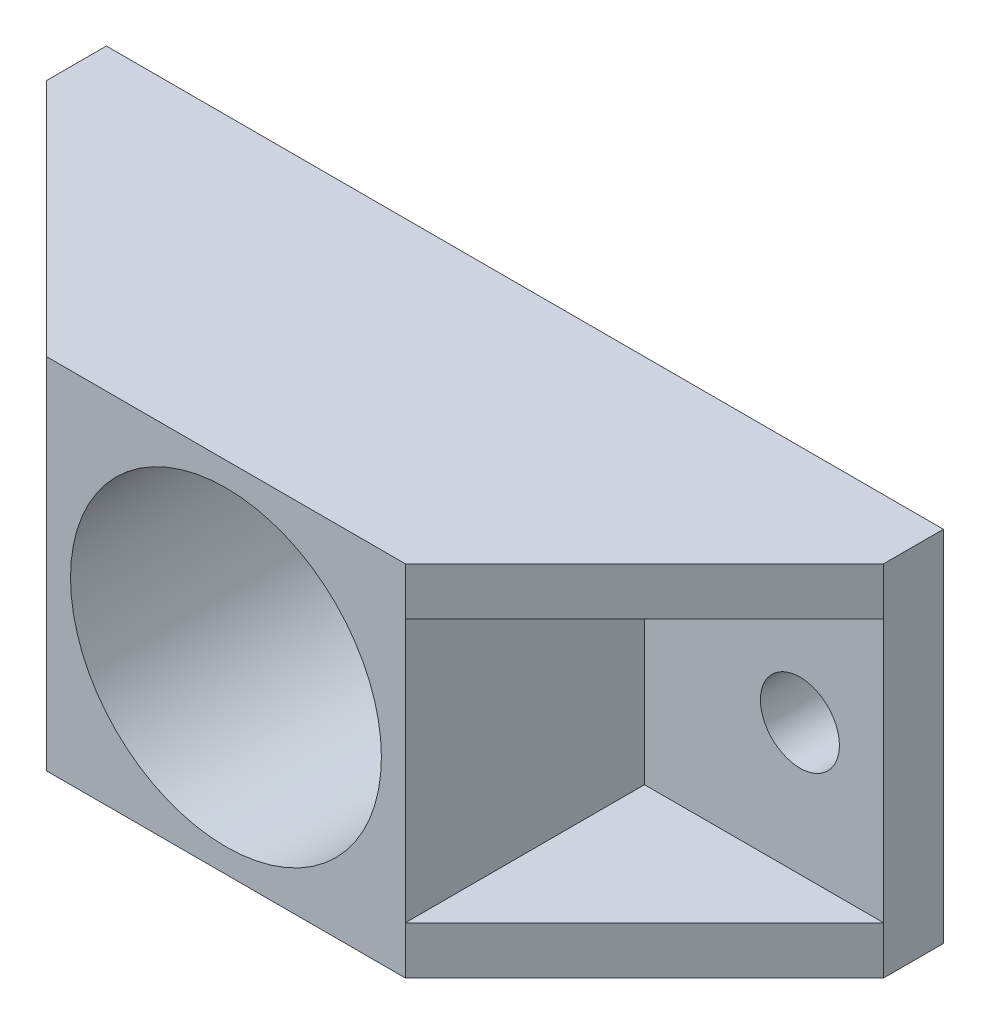
ISO-10303-21;
HEADER;
FILE_DESCRIPTION(('STEP AP214'),'2;1');
FILE_NAME('part.step','',(''),(''),'','','');
FILE_SCHEMA(('AUTOMOTIVE_DESIGN { 1 0 10303 214 1 1 1 1 }'));
ENDSEC;
DATA;
#1=APPLICATION_CONTEXT('core data for automotive mechanical design processes');
#2=APPLICATION_PROTOCOL_DEFINITION('international standard','automotive_design',2000,#1);
#3=PRODUCT_CONTEXT('',#1,'mechanical');
#4=PRODUCT('Part','Part','',(#3));
#5=PRODUCT_RELATED_PRODUCT_CATEGORY('part','',(#4));
#6=PRODUCT_DEFINITION_FORMATION('','',#4);
#7=PRODUCT_DEFINITION_CONTEXT('part definition',#1,'design');
#8=PRODUCT_DEFINITION('design','',#6,#7);
#9=PRODUCT_DEFINITION_SHAPE('','',#8);
#10=(LENGTH_UNIT() NAMED_UNIT(*) SI_UNIT(.MILLI.,.METRE.));
#11=(NAMED_UNIT(*) PLANE_ANGLE_UNIT() SI_UNIT($,.RADIAN.));
#12=(NAMED_UNIT(*) SI_UNIT($,.STERADIAN.) SOLID_ANGLE_UNIT());
#13=UNCERTAINTY_MEASURE_WITH_UNIT(LENGTH_MEASURE(1.E-05),#10,'distance_accuracy_value','');
#14=(GEOMETRIC_REPRESENTATION_CONTEXT(3) GLOBAL_UNCERTAINTY_ASSIGNED_CONTEXT((#13)) GLOBAL_UNIT_ASSIGNED_CONTEXT((#10,
#11,#12)) REPRESENTATION_CONTEXT('',''));
#15=CARTESIAN_POINT('',(0.,0.,0.));
#16=DIRECTION('',(0.,0.,1.));
#17=DIRECTION('',(1.,0.,0.));
#18=AXIS2_PLACEMENT_3D('',#15,#16,#17);
#19=CARTESIAN_POINT('',(0.,0.,5.));
#20=DIRECTION('',(0.,0.,-1.));
#21=DIRECTION('',(-1.,0.,0.));
#22=AXIS2_PLACEMENT_3D('',#19,#20,#21);
#23=PLANE('',#22);
#24=CARTESIAN_POINT('',(28.,0.,5.));
#25=DIRECTION('',(0.,0.,1.));
#26=DIRECTION('',(-1.,0.,0.));
#27=AXIS2_PLACEMENT_3D('',#24,#25,#26);
#28=CIRCLE('',#27,3.3);
#29=CARTESIAN_POINT('',(24.7,0.,5.));
#30=VERTEX_POINT('',#29);
#31=EDGE_CURVE('E173',#30,#30,#28,.T.);
#32=ORIENTED_EDGE('',*,*,#31,.F.);
#33=EDGE_LOOP('',(#32));
#34=FACE_BOUND('',#33,.T.);
#35=DIRECTION('',(1.,0.,0.));
#36=VECTOR('',#35,1.);
#37=CARTESIAN_POINT('',(35.,11.,5.));
#38=LINE('',#37,#36);
#39=CARTESIAN_POINT('',(15.,11.,5.));
#40=VERTEX_POINT('',#39);
#41=CARTESIAN_POINT('',(35.,11.,5.));
#42=VERTEX_POINT('',#41);
#43=EDGE_CURVE('E132',#40,#42,#38,.T.);
#44=ORIENTED_EDGE('',*,*,#43,.F.);
#45=DIRECTION('',(0.,1.,0.));
#46=VECTOR('',#45,1.);
#47=CARTESIAN_POINT('',(15.,-15.,5.));
#48=LINE('',#47,#46);
#49=CARTESIAN_POINT('',(15.,-11.,5.));
#50=VERTEX_POINT('',#49);
#51=EDGE_CURVE('E155',#50,#40,#48,.T.);
#52=ORIENTED_EDGE('',*,*,#51,.F.);
#53=DIRECTION('',(1.,0.,0.));
#54=VECTOR('',#53,1.);
#55=CARTESIAN_POINT('',(35.,-11.,5.));
#56=LINE('',#55,#54);
#57=CARTESIAN_POINT('',(35.,-11.,5.));
#58=VERTEX_POINT('',#57);
#59=EDGE_CURVE('E235',#50,#58,#56,.T.);
#60=ORIENTED_EDGE('',*,*,#59,.T.);
#61=DIRECTION('',(0.,1.,0.));
#62=VECTOR('',#61,1.);
#63=CARTESIAN_POINT('',(35.,15.,5.));
#64=LINE('',#63,#62);
#65=EDGE_CURVE('E198',#58,#42,#64,.T.);
#66=ORIENTED_EDGE('',*,*,#65,.T.);
#67=EDGE_LOOP('',(#44,#52,#60,#66));
#68=FACE_BOUND('',#67,.T.);
#69=ADVANCED_FACE('F35',(#34,#68),#23,.F.);
#70=CARTESIAN_POINT('',(15.,-15.,25.));
#71=DIRECTION('',(-1.,0.,0.));
#72=DIRECTION('',(0.,0.,1.));
#73=AXIS2_PLACEMENT_3D('',#70,#71,#72);
#74=PLANE('',#73);
#75=DIRECTION('',(0.,0.,-1.));
#76=VECTOR('',#75,1.);
#77=CARTESIAN_POINT('',(15.,11.,5.));
#78=LINE('',#77,#76);
#79=CARTESIAN_POINT('',(15.,11.,25.));
#80=VERTEX_POINT('',#79);
#81=EDGE_CURVE('E130',#80,#40,#78,.T.);
#82=ORIENTED_EDGE('',*,*,#81,.F.);
#83=DIRECTION('',(0.,1.,0.));
#84=VECTOR('',#83,1.);
#85=CARTESIAN_POINT('',(15.,-15.,25.));
#86=LINE('',#85,#84);
#87=CARTESIAN_POINT('',(15.,-11.,25.));
#88=VERTEX_POINT('',#87);
#89=EDGE_CURVE('E152',#88,#80,#86,.T.);
#90=ORIENTED_EDGE('',*,*,#89,.F.);
#91=DIRECTION('',(0.,0.,-1.));
#92=VECTOR('',#91,1.);
#93=CARTESIAN_POINT('',(15.,-11.,5.));
#94=LINE('',#93,#92);
#95=EDGE_CURVE('E233',#88,#50,#94,.T.);
#96=ORIENTED_EDGE('',*,*,#95,.T.);
#97=ORIENTED_EDGE('',*,*,#51,.T.);
#98=EDGE_LOOP('',(#82,#90,#96,#97));
#99=FACE_BOUND('',#98,.T.);
#100=ADVANCED_FACE('F150',(#99),#74,.F.);
#101=CARTESIAN_POINT('',(-28.,0.,5.));
#102=DIRECTION('',(0.,0.,1.));
#103=DIRECTION('',(1.,0.,0.));
#104=AXIS2_PLACEMENT_3D('',#101,#102,#103);
#105=CIRCLE('',#104,3.3);
#106=CARTESIAN_POINT('',(-24.7,0.,5.));
#107=VERTEX_POINT('',#106);
#108=EDGE_CURVE('E196',#107,#107,#105,.T.);
#109=ORIENTED_EDGE('',*,*,#108,.F.);
#110=EDGE_LOOP('',(#109));
#111=FACE_BOUND('',#110,.T.);
#112=DIRECTION('',(1.,0.,0.));
#113=VECTOR('',#112,1.);
#114=CARTESIAN_POINT('',(-15.,11.,5.));
#115=LINE('',#114,#113);
#116=CARTESIAN_POINT('',(-35.,11.,5.));
#117=VERTEX_POINT('',#116);
#118=CARTESIAN_POINT('',(-15.,11.,5.));
#119=VERTEX_POINT('',#118);
#120=EDGE_CURVE('E226',#117,#119,#115,.T.);
#121=ORIENTED_EDGE('',*,*,#120,.F.);
#122=DIRECTION('',(0.,-1.,0.));
#123=VECTOR('',#122,1.);
#124=CARTESIAN_POINT('',(-35.,15.,5.));
#125=LINE('',#124,#123);
#126=CARTESIAN_POINT('',(-35.,-11.,5.));
#127=VERTEX_POINT('',#126);
#128=EDGE_CURVE('E188',#117,#127,#125,.T.);
#129=ORIENTED_EDGE('',*,*,#128,.T.);
#130=DIRECTION('',(1.,0.,0.));
#131=VECTOR('',#130,1.);
#132=CARTESIAN_POINT('',(-15.,-11.,5.));
#133=LINE('',#132,#131);
#134=CARTESIAN_POINT('',(-15.,-11.,5.));
#135=VERTEX_POINT('',#134);
#136=EDGE_CURVE('E241',#127,#135,#133,.T.);
#137=ORIENTED_EDGE('',*,*,#136,.T.);
#138=DIRECTION('',(0.,-1.,0.));
#139=VECTOR('',#138,1.);
#140=CARTESIAN_POINT('',(-15.,-15.,5.));
#141=LINE('',#140,#139);
#142=EDGE_CURVE('E39',#119,#135,#141,.T.);
#143=ORIENTED_EDGE('',*,*,#142,.F.);
#144=EDGE_LOOP('',(#121,#129,#137,#143));
#145=FACE_BOUND('',#144,.T.);
#146=ADVANCED_FACE('F217',(#111,#145),#23,.F.);
#147=CARTESIAN_POINT('',(-15.,-15.,25.));
#148=DIRECTION('',(1.,0.,0.));
#149=DIRECTION('',(0.,0.,-1.));
#150=AXIS2_PLACEMENT_3D('',#147,#148,#149);
#151=PLANE('',#150);
#152=DIRECTION('',(0.,0.,1.));
#153=VECTOR('',#152,1.);
#154=CARTESIAN_POINT('',(-15.,11.,25.));
#155=LINE('',#154,#153);
#156=CARTESIAN_POINT('',(-15.,11.,25.));
#157=VERTEX_POINT('',#156);
#158=EDGE_CURVE('E229',#119,#157,#155,.T.);
#159=ORIENTED_EDGE('',*,*,#158,.F.);
#160=ORIENTED_EDGE('',*,*,#142,.T.);
#161=DIRECTION('',(0.,0.,1.));
#162=VECTOR('',#161,1.);
#163=CARTESIAN_POINT('',(-15.,-11.,25.));
#164=LINE('',#163,#162);
#165=CARTESIAN_POINT('',(-15.,-11.,25.));
#166=VERTEX_POINT('',#165);
#167=EDGE_CURVE('E244',#135,#166,#164,.T.);
#168=ORIENTED_EDGE('',*,*,#167,.T.);
#169=DIRECTION('',(0.,-1.,0.));
#170=VECTOR('',#169,1.);
#171=CARTESIAN_POINT('',(-15.,-15.,25.));
#172=LINE('',#171,#170);
#173=EDGE_CURVE('E175',#157,#166,#172,.T.);
#174=ORIENTED_EDGE('',*,*,#173,.F.);
#175=EDGE_LOOP('',(#159,#160,#168,#174));
#176=FACE_BOUND('',#175,.T.);
#177=ADVANCED_FACE('F275',(#176),#151,.F.);
#178=CARTESIAN_POINT('',(0.,0.,0.));
#179=DIRECTION('',(0.,0.,-1.));
#180=DIRECTION('',(-1.,0.,0.));
#181=AXIS2_PLACEMENT_3D('',#178,#179,#180);
#182=PLANE('',#181);
#183=CARTESIAN_POINT('',(0.,0.,0.));
#184=DIRECTION('',(0.,0.,1.));
#185=DIRECTION('',(1.,0.,0.));
#186=AXIS2_PLACEMENT_3D('',#183,#184,#185);
#187=CIRCLE('',#186,13.);
#188=CARTESIAN_POINT('',(13.,0.,0.));
#189=VERTEX_POINT('',#188);
#190=EDGE_CURVE('E258',#189,#189,#187,.T.);
#191=ORIENTED_EDGE('',*,*,#190,.T.);
#192=EDGE_LOOP('',(#191));
#193=FACE_BOUND('',#192,.T.);
#194=CARTESIAN_POINT('',(-28.,0.,0.));
#195=DIRECTION('',(0.,0.,1.));
#196=DIRECTION('',(1.,0.,0.));
#197=AXIS2_PLACEMENT_3D('',#194,#195,#196);
#198=CIRCLE('',#197,3.3);
#199=CARTESIAN_POINT('',(-24.7,0.,0.));
#200=VERTEX_POINT('',#199);
#201=EDGE_CURVE('E201',#200,#200,#198,.T.);
#202=ORIENTED_EDGE('',*,*,#201,.T.);
#203=EDGE_LOOP('',(#202));
#204=FACE_BOUND('',#203,.T.);
#205=DIRECTION('',(0.,-1.,0.));
#206=VECTOR('',#205,1.);
#207=CARTESIAN_POINT('',(-35.,15.,0.));
#208=LINE('',#207,#206);
#209=CARTESIAN_POINT('',(-35.,15.,0.));
#210=VERTEX_POINT('',#209);
#211=CARTESIAN_POINT('',(-35.,-15.,0.));
#212=VERTEX_POINT('',#211);
#213=EDGE_CURVE('E193',#210,#212,#208,.T.);
#214=ORIENTED_EDGE('',*,*,#213,.F.);
#215=DIRECTION('',(-1.,0.,0.));
#216=VECTOR('',#215,1.);
#217=CARTESIAN_POINT('',(35.,15.,0.));
#218=LINE('',#217,#216);
#219=CARTESIAN_POINT('',(35.,15.,0.));
#220=VERTEX_POINT('',#219);
#221=EDGE_CURVE('E186',#220,#210,#218,.T.);
#222=ORIENTED_EDGE('',*,*,#221,.F.);
#223=DIRECTION('',(0.,1.,0.));
#224=VECTOR('',#223,1.);
#225=CARTESIAN_POINT('',(35.,15.,0.));
#226=LINE('',#225,#224);
#227=CARTESIAN_POINT('',(35.,-15.,0.));
#228=VERTEX_POINT('',#227);
#229=EDGE_CURVE('E189',#228,#220,#226,.T.);
#230=ORIENTED_EDGE('',*,*,#229,.F.);
#231=DIRECTION('',(1.,0.,0.));
#232=VECTOR('',#231,1.);
#233=CARTESIAN_POINT('',(35.,-15.,0.));
#234=LINE('',#233,#232);
#235=EDGE_CURVE('E191',#212,#228,#234,.T.);
#236=ORIENTED_EDGE('',*,*,#235,.F.);
#237=EDGE_LOOP('',(#214,#222,#230,#236));
#238=FACE_BOUND('',#237,.T.);
#239=CARTESIAN_POINT('',(28.,0.,0.));
#240=DIRECTION('',(0.,0.,1.));
#241=DIRECTION('',(-1.,0.,0.));
#242=AXIS2_PLACEMENT_3D('',#239,#240,#241);
#243=CIRCLE('',#242,3.3);
#244=CARTESIAN_POINT('',(24.7,0.,0.));
#245=VERTEX_POINT('',#244);
#246=EDGE_CURVE('E168',#245,#245,#243,.T.);
#247=ORIENTED_EDGE('',*,*,#246,.T.);
#248=EDGE_LOOP('',(#247));
#249=FACE_BOUND('',#248,.T.);
#250=ADVANCED_FACE('F328',(#193,#204,#238,#249),#182,.T.);
#251=CARTESIAN_POINT('',(-35.,15.,5.));
#252=DIRECTION('',(1.,0.,0.));
#253=DIRECTION('',(0.,1.,0.));
#254=AXIS2_PLACEMENT_3D('',#251,#252,#253);
#255=PLANE('',#254);
#256=ORIENTED_EDGE('',*,*,#213,.T.);
#257=DIRECTION('',(0.,0.,-1.));
#258=VECTOR('',#257,1.);
#259=CARTESIAN_POINT('',(-35.,-15.,5.));
#260=LINE('',#259,#258);
#261=CARTESIAN_POINT('',(-35.,-15.,5.));
#262=VERTEX_POINT('',#261);
#263=EDGE_CURVE('E11',#262,#212,#260,.T.);
#264=ORIENTED_EDGE('',*,*,#263,.F.);
#265=DIRECTION('',(0.,-1.,0.));
#266=VECTOR('',#265,1.);
#267=CARTESIAN_POINT('',(-35.,-11.,5.));
#268=LINE('',#267,#266);
#269=EDGE_CURVE('E253',#127,#262,#268,.T.);
#270=ORIENTED_EDGE('',*,*,#269,.F.);
#271=ORIENTED_EDGE('',*,*,#128,.F.);
#272=CARTESIAN_POINT('',(-35.,15.,5.));
#273=VERTEX_POINT('',#272);
#274=EDGE_CURVE('E199',#273,#117,#125,.T.);
#275=ORIENTED_EDGE('',*,*,#274,.F.);
#276=DIRECTION('',(0.,0.,-1.));
#277=VECTOR('',#276,1.);
#278=CARTESIAN_POINT('',(-35.,15.,5.));
#279=LINE('',#278,#277);
#280=EDGE_CURVE('E182',#273,#210,#279,.T.);
#281=ORIENTED_EDGE('',*,*,#280,.T.);
#282=EDGE_LOOP('',(#256,#264,#270,#271,#275,#281));
#283=FACE_BOUND('',#282,.T.);
#284=ADVANCED_FACE('F37',(#283),#255,.F.);
#285=CARTESIAN_POINT('',(35.,-15.,5.));
#286=DIRECTION('',(0.,1.,0.));
#287=DIRECTION('',(0.,0.,1.));
#288=AXIS2_PLACEMENT_3D('',#285,#286,#287);
#289=PLANE('',#288);
#290=DIRECTION('',(0.,0.,-1.));
#291=VECTOR('',#290,1.);
#292=CARTESIAN_POINT('',(35.,-15.,5.));
#293=LINE('',#292,#291);
#294=CARTESIAN_POINT('',(35.,-15.,5.));
#295=VERTEX_POINT('',#294);
#296=EDGE_CURVE('E45',#295,#228,#293,.T.);
#297=ORIENTED_EDGE('',*,*,#296,.F.);
#298=DIRECTION('',(-0.707106781186547,0.,0.707106781186548));
#299=VECTOR('',#298,1.);
#300=CARTESIAN_POINT('',(15.,-15.,25.));
#301=LINE('',#300,#299);
#302=CARTESIAN_POINT('',(15.,-15.,25.));
#303=VERTEX_POINT('',#302);
#304=EDGE_CURVE('E231',#295,#303,#301,.T.);
#305=ORIENTED_EDGE('',*,*,#304,.T.);
#306=DIRECTION('',(1.,0.,0.));
#307=VECTOR('',#306,1.);
#308=CARTESIAN_POINT('',(15.,-15.,25.));
#309=LINE('',#308,#307);
#310=CARTESIAN_POINT('',(-15.,-15.,25.));
#311=VERTEX_POINT('',#310);
#312=EDGE_CURVE('E161',#311,#303,#309,.T.);
#313=ORIENTED_EDGE('',*,*,#312,.F.);
#314=DIRECTION('',(-0.707106781186547,0.,-0.707106781186548));
#315=VECTOR('',#314,1.);
#316=CARTESIAN_POINT('',(-35.,-15.,5.));
#317=LINE('',#316,#315);
#318=EDGE_CURVE('E238',#311,#262,#317,.T.);
#319=ORIENTED_EDGE('',*,*,#318,.T.);
#320=ORIENTED_EDGE('',*,*,#263,.T.);
#321=ORIENTED_EDGE('',*,*,#235,.T.);
#322=EDGE_LOOP('',(#297,#305,#313,#319,#320,#321));
#323=FACE_BOUND('',#322,.T.);
#324=ADVANCED_FACE('F285',(#323),#289,.F.);
#325=CARTESIAN_POINT('',(35.,15.,5.));
#326=DIRECTION('',(-1.,0.,0.));
#327=DIRECTION('',(0.,-1.,0.));
#328=AXIS2_PLACEMENT_3D('',#325,#326,#327);
#329=PLANE('',#328);
#330=ORIENTED_EDGE('',*,*,#229,.T.);
#331=DIRECTION('',(0.,0.,-1.));
#332=VECTOR('',#331,1.);
#333=CARTESIAN_POINT('',(35.,15.,5.));
#334=LINE('',#333,#332);
#335=CARTESIAN_POINT('',(35.,15.,5.));
#336=VERTEX_POINT('',#335);
#337=EDGE_CURVE('E179',#336,#220,#334,.T.);
#338=ORIENTED_EDGE('',*,*,#337,.F.);
#339=DIRECTION('',(0.,1.,0.));
#340=VECTOR('',#339,1.);
#341=CARTESIAN_POINT('',(35.,11.,5.));
#342=LINE('',#341,#340);
#343=EDGE_CURVE('E145',#42,#336,#342,.T.);
#344=ORIENTED_EDGE('',*,*,#343,.F.);
#345=ORIENTED_EDGE('',*,*,#65,.F.);
#346=EDGE_CURVE('E185',#295,#58,#64,.T.);
#347=ORIENTED_EDGE('',*,*,#346,.F.);
#348=ORIENTED_EDGE('',*,*,#296,.T.);
#349=EDGE_LOOP('',(#330,#338,#344,#345,#347,#348));
#350=FACE_BOUND('',#349,.T.);
#351=ADVANCED_FACE('F291',(#350),#329,.F.);
#352=CARTESIAN_POINT('',(35.,15.,5.));
#353=DIRECTION('',(0.,-1.,0.));
#354=DIRECTION('',(1.,0.,0.));
#355=AXIS2_PLACEMENT_3D('',#352,#353,#354);
#356=PLANE('',#355);
#357=ORIENTED_EDGE('',*,*,#280,.F.);
#358=DIRECTION('',(-0.707106781186547,0.,-0.707106781186548));
#359=VECTOR('',#358,1.);
#360=CARTESIAN_POINT('',(-35.,15.,5.));
#361=LINE('',#360,#359);
#362=CARTESIAN_POINT('',(-15.,15.,25.));
#363=VERTEX_POINT('',#362);
#364=EDGE_CURVE('E224',#363,#273,#361,.T.);
#365=ORIENTED_EDGE('',*,*,#364,.F.);
#366=DIRECTION('',(-1.,0.,0.));
#367=VECTOR('',#366,1.);
#368=CARTESIAN_POINT('',(15.,15.,25.));
#369=LINE('',#368,#367);
#370=CARTESIAN_POINT('',(15.,15.,25.));
#371=VERTEX_POINT('',#370);
#372=EDGE_CURVE('E163',#371,#363,#369,.T.);
#373=ORIENTED_EDGE('',*,*,#372,.F.);
#374=DIRECTION('',(-0.707106781186547,0.,0.707106781186548));
#375=VECTOR('',#374,1.);
#376=CARTESIAN_POINT('',(15.,15.,25.));
#377=LINE('',#376,#375);
#378=EDGE_CURVE('E140',#336,#371,#377,.T.);
#379=ORIENTED_EDGE('',*,*,#378,.F.);
#380=ORIENTED_EDGE('',*,*,#337,.T.);
#381=ORIENTED_EDGE('',*,*,#221,.T.);
#382=EDGE_LOOP('',(#357,#365,#373,#379,#380,#381));
#383=FACE_BOUND('',#382,.T.);
#384=ADVANCED_FACE('F295',(#383),#356,.F.);
#385=CARTESIAN_POINT('',(-28.,0.,5.));
#386=DIRECTION('',(0.,0.,-1.));
#387=DIRECTION('',(-1.,0.,0.));
#388=AXIS2_PLACEMENT_3D('',#385,#386,#387);
#389=CYLINDRICAL_SURFACE('',#388,3.3);
#390=ORIENTED_EDGE('',*,*,#108,.T.);
#391=EDGE_LOOP('',(#390));
#392=FACE_BOUND('',#391,.T.);
#393=ORIENTED_EDGE('',*,*,#201,.F.);
#394=EDGE_LOOP('',(#393));
#395=FACE_BOUND('',#394,.T.);
#396=ADVANCED_FACE('F331',(#392,#395),#389,.F.);
#397=CARTESIAN_POINT('',(28.,0.,5.));
#398=DIRECTION('',(0.,0.,-1.));
#399=DIRECTION('',(-1.,0.,0.));
#400=AXIS2_PLACEMENT_3D('',#397,#398,#399);
#401=CYLINDRICAL_SURFACE('',#400,3.3);
#402=ORIENTED_EDGE('',*,*,#31,.T.);
#403=EDGE_LOOP('',(#402));
#404=FACE_BOUND('',#403,.T.);
#405=ORIENTED_EDGE('',*,*,#246,.F.);
#406=EDGE_LOOP('',(#405));
#407=FACE_BOUND('',#406,.T.);
#408=ADVANCED_FACE('F211',(#404,#407),#401,.F.);
#409=CARTESIAN_POINT('',(0.,0.,25.));
#410=DIRECTION('',(0.,0.,1.));
#411=DIRECTION('',(1.,0.,0.));
#412=AXIS2_PLACEMENT_3D('',#409,#410,#411);
#413=PLANE('',#412);
#414=CARTESIAN_POINT('',(0.,0.,25.));
#415=DIRECTION('',(0.,0.,1.));
#416=DIRECTION('',(1.,0.,0.));
#417=AXIS2_PLACEMENT_3D('',#414,#415,#416);
#418=CIRCLE('',#417,13.);
#419=CARTESIAN_POINT('',(13.,0.,25.));
#420=VERTEX_POINT('',#419);
#421=EDGE_CURVE('E255',#420,#420,#418,.T.);
#422=ORIENTED_EDGE('',*,*,#421,.F.);
#423=EDGE_LOOP('',(#422));
#424=FACE_BOUND('',#423,.T.);
#425=EDGE_CURVE('E164',#363,#157,#172,.T.);
#426=ORIENTED_EDGE('',*,*,#425,.T.);
#427=ORIENTED_EDGE('',*,*,#173,.T.);
#428=DIRECTION('',(0.,-1.,0.));
#429=VECTOR('',#428,1.);
#430=CARTESIAN_POINT('',(-15.,-11.,25.));
#431=LINE('',#430,#429);
#432=EDGE_CURVE('E250',#166,#311,#431,.T.);
#433=ORIENTED_EDGE('',*,*,#432,.T.);
#434=ORIENTED_EDGE('',*,*,#312,.T.);
#435=EDGE_CURVE('E160',#303,#88,#86,.T.);
#436=ORIENTED_EDGE('',*,*,#435,.T.);
#437=ORIENTED_EDGE('',*,*,#89,.T.);
#438=DIRECTION('',(0.,1.,0.));
#439=VECTOR('',#438,1.);
#440=CARTESIAN_POINT('',(15.,11.,25.));
#441=LINE('',#440,#439);
#442=EDGE_CURVE('E137',#80,#371,#441,.T.);
#443=ORIENTED_EDGE('',*,*,#442,.T.);
#444=ORIENTED_EDGE('',*,*,#372,.T.);
#445=EDGE_LOOP('',(#426,#427,#433,#434,#436,#437,#443,#444));
#446=FACE_BOUND('',#445,.T.);
#447=ADVANCED_FACE('F158',(#424,#446),#413,.T.);
#448=CARTESIAN_POINT('',(0.,0.,0.));
#449=DIRECTION('',(0.,0.,1.));
#450=DIRECTION('',(1.,0.,0.));
#451=AXIS2_PLACEMENT_3D('',#448,#449,#450);
#452=CYLINDRICAL_SURFACE('',#451,13.);
#453=ORIENTED_EDGE('',*,*,#190,.F.);
#454=EDGE_LOOP('',(#453));
#455=FACE_BOUND('',#454,.T.);
#456=ORIENTED_EDGE('',*,*,#421,.T.);
#457=EDGE_LOOP('',(#456));
#458=FACE_BOUND('',#457,.T.);
#459=ADVANCED_FACE('F317',(#455,#458),#452,.F.);
#460=CARTESIAN_POINT('',(-35.,-11.,5.));
#461=DIRECTION('',(-0.707106781186548,0.,0.707106781186547));
#462=DIRECTION('',(0.707106781186547,0.,0.707106781186548));
#463=AXIS2_PLACEMENT_3D('',#460,#461,#462);
#464=PLANE('',#463);
#465=ORIENTED_EDGE('',*,*,#318,.F.);
#466=ORIENTED_EDGE('',*,*,#432,.F.);
#467=DIRECTION('',(-0.707106781186547,0.,-0.707106781186548));
#468=VECTOR('',#467,1.);
#469=CARTESIAN_POINT('',(-35.,-11.,5.));
#470=LINE('',#469,#468);
#471=EDGE_CURVE('E247',#166,#127,#470,.T.);
#472=ORIENTED_EDGE('',*,*,#471,.T.);
#473=ORIENTED_EDGE('',*,*,#269,.T.);
#474=EDGE_LOOP('',(#465,#466,#472,#473));
#475=FACE_BOUND('',#474,.T.);
#476=ADVANCED_FACE('F269',(#475),#464,.T.);
#477=CARTESIAN_POINT('',(0.,-11.,0.));
#478=DIRECTION('',(0.,-1.,0.));
#479=DIRECTION('',(0.,0.,-1.));
#480=AXIS2_PLACEMENT_3D('',#477,#478,#479);
#481=PLANE('',#480);
#482=ORIENTED_EDGE('',*,*,#136,.F.);
#483=ORIENTED_EDGE('',*,*,#471,.F.);
#484=ORIENTED_EDGE('',*,*,#167,.F.);
#485=EDGE_LOOP('',(#482,#483,#484));
#486=FACE_BOUND('',#485,.T.);
#487=ADVANCED_FACE('F274',(#486),#481,.F.);
#488=CARTESIAN_POINT('',(15.,-11.,25.));
#489=DIRECTION('',(0.707106781186548,0.,0.707106781186547));
#490=DIRECTION('',(0.707106781186547,0.,-0.707106781186548));
#491=AXIS2_PLACEMENT_3D('',#488,#489,#490);
#492=PLANE('',#491);
#493=ORIENTED_EDGE('',*,*,#304,.F.);
#494=ORIENTED_EDGE('',*,*,#346,.T.);
#495=DIRECTION('',(-0.707106781186547,0.,0.707106781186548));
#496=VECTOR('',#495,1.);
#497=CARTESIAN_POINT('',(15.,-11.,25.));
#498=LINE('',#497,#496);
#499=EDGE_CURVE('E61',#58,#88,#498,.T.);
#500=ORIENTED_EDGE('',*,*,#499,.T.);
#501=ORIENTED_EDGE('',*,*,#435,.F.);
#502=EDGE_LOOP('',(#493,#494,#500,#501));
#503=FACE_BOUND('',#502,.T.);
#504=ADVANCED_FACE('F287',(#503),#492,.T.);
#505=CARTESIAN_POINT('',(0.,-11.,0.));
#506=DIRECTION('',(0.,-1.,0.));
#507=DIRECTION('',(0.,0.,-1.));
#508=AXIS2_PLACEMENT_3D('',#505,#506,#507);
#509=PLANE('',#508);
#510=ORIENTED_EDGE('',*,*,#95,.F.);
#511=ORIENTED_EDGE('',*,*,#499,.F.);
#512=ORIENTED_EDGE('',*,*,#59,.F.);
#513=EDGE_LOOP('',(#510,#511,#512));
#514=FACE_BOUND('',#513,.T.);
#515=ADVANCED_FACE('F290',(#514),#509,.F.);
#516=CARTESIAN_POINT('',(-35.,11.,5.));
#517=DIRECTION('',(0.707106781186548,0.,-0.707106781186547));
#518=DIRECTION('',(-0.707106781186547,0.,-0.707106781186548));
#519=AXIS2_PLACEMENT_3D('',#516,#517,#518);
#520=PLANE('',#519);
#521=ORIENTED_EDGE('',*,*,#364,.T.);
#522=ORIENTED_EDGE('',*,*,#274,.T.);
#523=DIRECTION('',(-0.707106781186547,0.,-0.707106781186548));
#524=VECTOR('',#523,1.);
#525=CARTESIAN_POINT('',(-35.,11.,5.));
#526=LINE('',#525,#524);
#527=EDGE_CURVE('E53',#157,#117,#526,.T.);
#528=ORIENTED_EDGE('',*,*,#527,.F.);
#529=ORIENTED_EDGE('',*,*,#425,.F.);
#530=EDGE_LOOP('',(#521,#522,#528,#529));
#531=FACE_BOUND('',#530,.T.);
#532=ADVANCED_FACE('F298',(#531),#520,.F.);
#533=CARTESIAN_POINT('',(0.,11.,0.));
#534=DIRECTION('',(0.,1.,0.));
#535=DIRECTION('',(0.,0.,-1.));
#536=AXIS2_PLACEMENT_3D('',#533,#534,#535);
#537=PLANE('',#536);
#538=ORIENTED_EDGE('',*,*,#120,.T.);
#539=ORIENTED_EDGE('',*,*,#158,.T.);
#540=ORIENTED_EDGE('',*,*,#527,.T.);
#541=EDGE_LOOP('',(#538,#539,#540));
#542=FACE_BOUND('',#541,.T.);
#543=ADVANCED_FACE('F300',(#542),#537,.F.);
#544=CARTESIAN_POINT('',(15.,11.,25.));
#545=DIRECTION('',(-0.707106781186548,0.,-0.707106781186547));
#546=DIRECTION('',(-0.707106781186547,0.,0.707106781186548));
#547=AXIS2_PLACEMENT_3D('',#544,#545,#546);
#548=PLANE('',#547);
#549=ORIENTED_EDGE('',*,*,#378,.T.);
#550=ORIENTED_EDGE('',*,*,#442,.F.);
#551=DIRECTION('',(-0.707106781186547,0.,0.707106781186548));
#552=VECTOR('',#551,1.);
#553=CARTESIAN_POINT('',(15.,11.,25.));
#554=LINE('',#553,#552);
#555=EDGE_CURVE('E126',#42,#80,#554,.T.);
#556=ORIENTED_EDGE('',*,*,#555,.F.);
#557=ORIENTED_EDGE('',*,*,#343,.T.);
#558=EDGE_LOOP('',(#549,#550,#556,#557));
#559=FACE_BOUND('',#558,.T.);
#560=ADVANCED_FACE('F138',(#559),#548,.F.);
#561=CARTESIAN_POINT('',(0.,11.,0.));
#562=DIRECTION('',(0.,1.,0.));
#563=DIRECTION('',(0.,0.,-1.));
#564=AXIS2_PLACEMENT_3D('',#561,#562,#563);
#565=PLANE('',#564);
#566=ORIENTED_EDGE('',*,*,#81,.T.);
#567=ORIENTED_EDGE('',*,*,#43,.T.);
#568=ORIENTED_EDGE('',*,*,#555,.T.);
#569=EDGE_LOOP('',(#566,#567,#568));
#570=FACE_BOUND('',#569,.T.);
#571=ADVANCED_FACE('F128',(#570),#565,.F.);
#572=CLOSED_SHELL('',(#69,#100,#146,#177,#250,#284,#324,#351,#384,#396,#408,#447,#459,#476,#487,
#504,#515,#532,#543,#560,#571));
#573=MANIFOLD_SOLID_BREP('B2',#572);
#574=ADVANCED_BREP_SHAPE_REPRESENTATION('',(#18,#573),#14);
#575=SHAPE_DEFINITION_REPRESENTATION(#9,#574);
ENDSEC;
END-ISO-10303-21;
